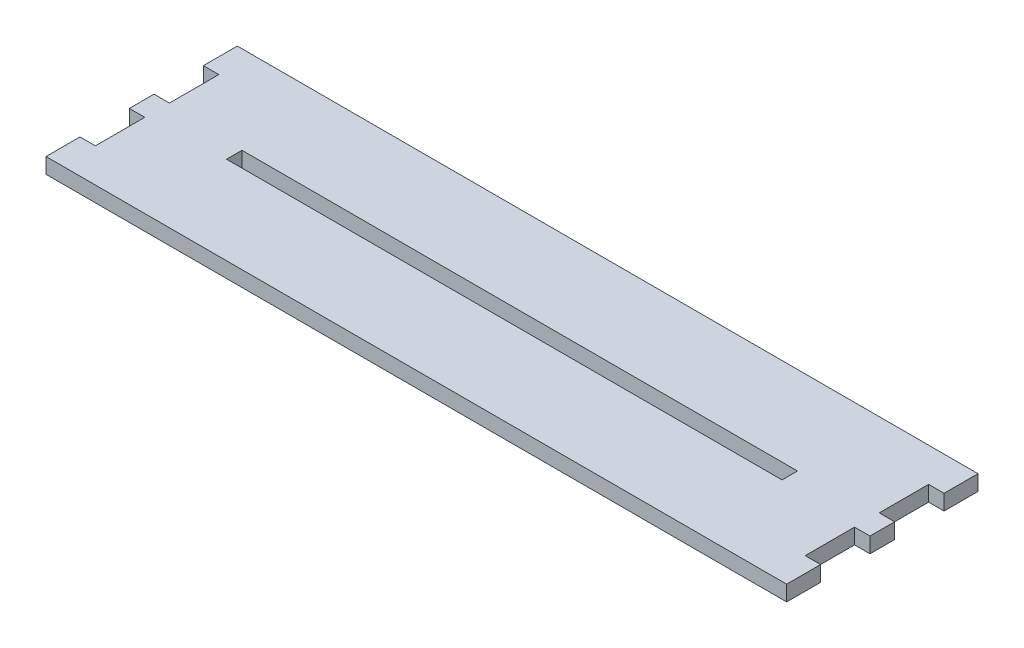
ISO-10303-21;
HEADER;
FILE_DESCRIPTION(('STEP AP214'),'2;1');
FILE_NAME('part.step','',(''),(''),'','','');
FILE_SCHEMA(('AUTOMOTIVE_DESIGN { 1 0 10303 214 1 1 1 1 }'));
ENDSEC;
DATA;
#1=APPLICATION_CONTEXT('core data for automotive mechanical design processes');
#2=APPLICATION_PROTOCOL_DEFINITION('international standard','automotive_design',2000,#1);
#3=PRODUCT_CONTEXT('',#1,'mechanical');
#4=PRODUCT('Part','Part','',(#3));
#5=PRODUCT_RELATED_PRODUCT_CATEGORY('part','',(#4));
#6=PRODUCT_DEFINITION_FORMATION('','',#4);
#7=PRODUCT_DEFINITION_CONTEXT('part definition',#1,'design');
#8=PRODUCT_DEFINITION('design','',#6,#7);
#9=PRODUCT_DEFINITION_SHAPE('','',#8);
#10=(LENGTH_UNIT() NAMED_UNIT(*) SI_UNIT(.MILLI.,.METRE.));
#11=(NAMED_UNIT(*) PLANE_ANGLE_UNIT() SI_UNIT($,.RADIAN.));
#12=(NAMED_UNIT(*) SI_UNIT($,.STERADIAN.) SOLID_ANGLE_UNIT());
#13=UNCERTAINTY_MEASURE_WITH_UNIT(LENGTH_MEASURE(1.E-05),#10,'distance_accuracy_value','');
#14=(GEOMETRIC_REPRESENTATION_CONTEXT(3) GLOBAL_UNCERTAINTY_ASSIGNED_CONTEXT((#13)) GLOBAL_UNIT_ASSIGNED_CONTEXT((#10,
#11,#12)) REPRESENTATION_CONTEXT('',''));
#15=CARTESIAN_POINT('',(0.,0.,0.));
#16=DIRECTION('',(0.,0.,1.));
#17=DIRECTION('',(1.,0.,0.));
#18=AXIS2_PLACEMENT_3D('',#15,#16,#17);
#19=CARTESIAN_POINT('',(-42.8526222222222,3.175,-17.4639111111111));
#20=DIRECTION('',(1.,0.,0.));
#21=DIRECTION('',(0.,0.,-1.));
#22=AXIS2_PLACEMENT_3D('',#19,#20,#21);
#23=PLANE('',#22);
#24=DIRECTION('',(0.,0.,1.));
#25=VECTOR('',#24,1.);
#26=CARTESIAN_POINT('',(-42.8526222222222,0.,-17.4639111111111));
#27=LINE('',#26,#25);
#28=CARTESIAN_POINT('',(-42.8526222222222,0.,-17.4639111111111));
#29=VERTEX_POINT('',#28);
#30=CARTESIAN_POINT('',(-42.8526222222222,0.,-10.4789111111111));
#31=VERTEX_POINT('',#30);
#32=EDGE_CURVE('E225',#29,#31,#27,.T.);
#33=ORIENTED_EDGE('',*,*,#32,.T.);
#34=DIRECTION('',(0.,-1.,0.));
#35=VECTOR('',#34,1.);
#36=CARTESIAN_POINT('',(-42.8526222222222,3.175,-10.4789111111111));
#37=LINE('',#36,#35);
#38=CARTESIAN_POINT('',(-42.8526222222222,3.175,-10.4789111111111));
#39=VERTEX_POINT('',#38);
#40=EDGE_CURVE('E11',#39,#31,#37,.T.);
#41=ORIENTED_EDGE('',*,*,#40,.F.);
#42=DIRECTION('',(0.,0.,1.));
#43=VECTOR('',#42,1.);
#44=CARTESIAN_POINT('',(-42.8526222222222,3.175,-17.4639111111111));
#45=LINE('',#44,#43);
#46=CARTESIAN_POINT('',(-42.8526222222222,3.175,-17.4639111111111));
#47=VERTEX_POINT('',#46);
#48=EDGE_CURVE('E229',#47,#39,#45,.T.);
#49=ORIENTED_EDGE('',*,*,#48,.F.);
#50=DIRECTION('',(0.,-1.,0.));
#51=VECTOR('',#50,1.);
#52=CARTESIAN_POINT('',(-42.8526222222222,3.175,-17.4639111111111));
#53=LINE('',#52,#51);
#54=EDGE_CURVE('E280',#47,#29,#53,.T.);
#55=ORIENTED_EDGE('',*,*,#54,.T.);
#56=EDGE_LOOP('',(#33,#41,#49,#55));
#57=FACE_BOUND('',#56,.T.);
#58=ADVANCED_FACE('F33',(#57),#23,.F.);
#59=CARTESIAN_POINT('',(-39.6776222222222,3.175,-10.4789111111111));
#60=DIRECTION('',(0.,0.,1.));
#61=DIRECTION('',(1.,0.,0.));
#62=AXIS2_PLACEMENT_3D('',#59,#60,#61);
#63=PLANE('',#62);
#64=DIRECTION('',(-1.,0.,0.));
#65=VECTOR('',#64,1.);
#66=CARTESIAN_POINT('',(-39.6776222222222,0.,-10.4789111111111));
#67=LINE('',#66,#65);
#68=CARTESIAN_POINT('',(-39.6776222222222,0.,-10.4789111111111));
#69=VERTEX_POINT('',#68);
#70=EDGE_CURVE('E283',#69,#31,#67,.T.);
#71=ORIENTED_EDGE('',*,*,#70,.F.);
#72=DIRECTION('',(0.,-1.,0.));
#73=VECTOR('',#72,1.);
#74=CARTESIAN_POINT('',(-39.6776222222222,3.175,-10.4789111111111));
#75=LINE('',#74,#73);
#76=CARTESIAN_POINT('',(-39.6776222222222,3.175,-10.4789111111111));
#77=VERTEX_POINT('',#76);
#78=EDGE_CURVE('E40',#77,#69,#75,.T.);
#79=ORIENTED_EDGE('',*,*,#78,.F.);
#80=DIRECTION('',(-1.,0.,0.));
#81=VECTOR('',#80,1.);
#82=CARTESIAN_POINT('',(-39.6776222222222,3.175,-10.4789111111111));
#83=LINE('',#82,#81);
#84=EDGE_CURVE('E231',#77,#39,#83,.T.);
#85=ORIENTED_EDGE('',*,*,#84,.T.);
#86=ORIENTED_EDGE('',*,*,#40,.T.);
#87=EDGE_LOOP('',(#71,#79,#85,#86));
#88=FACE_BOUND('',#87,.T.);
#89=ADVANCED_FACE('F384',(#88),#63,.T.);
#90=CARTESIAN_POINT('',(-39.6776222222222,3.175,-10.4789111111111));
#91=DIRECTION('',(1.,0.,0.));
#92=DIRECTION('',(0.,0.,-1.));
#93=AXIS2_PLACEMENT_3D('',#90,#91,#92);
#94=PLANE('',#93);
#95=DIRECTION('',(0.,0.,1.));
#96=VECTOR('',#95,1.);
#97=CARTESIAN_POINT('',(-39.6776222222222,0.,-10.4789111111111));
#98=LINE('',#97,#96);
#99=CARTESIAN_POINT('',(-39.6776222222222,0.,-0.318911111111101));
#100=VERTEX_POINT('',#99);
#101=EDGE_CURVE('E286',#69,#100,#98,.T.);
#102=ORIENTED_EDGE('',*,*,#101,.T.);
#103=DIRECTION('',(0.,-1.,0.));
#104=VECTOR('',#103,1.);
#105=CARTESIAN_POINT('',(-39.6776222222222,3.175,-0.318911111111101));
#106=LINE('',#105,#104);
#107=CARTESIAN_POINT('',(-39.6776222222222,3.175,-0.318911111111101));
#108=VERTEX_POINT('',#107);
#109=EDGE_CURVE('E371',#108,#100,#106,.T.);
#110=ORIENTED_EDGE('',*,*,#109,.F.);
#111=DIRECTION('',(0.,0.,1.));
#112=VECTOR('',#111,1.);
#113=CARTESIAN_POINT('',(-39.6776222222222,3.175,-10.4789111111111));
#114=LINE('',#113,#112);
#115=EDGE_CURVE('E235',#77,#108,#114,.T.);
#116=ORIENTED_EDGE('',*,*,#115,.F.);
#117=ORIENTED_EDGE('',*,*,#78,.T.);
#118=EDGE_LOOP('',(#102,#110,#116,#117));
#119=FACE_BOUND('',#118,.T.);
#120=ADVANCED_FACE('F376',(#119),#94,.F.);
#121=CARTESIAN_POINT('',(-39.6776222222222,3.175,-0.318911111111101));
#122=DIRECTION('',(0.,0.,1.));
#123=DIRECTION('',(1.,0.,0.));
#124=AXIS2_PLACEMENT_3D('',#121,#122,#123);
#125=PLANE('',#124);
#126=DIRECTION('',(-1.,0.,0.));
#127=VECTOR('',#126,1.);
#128=CARTESIAN_POINT('',(-39.6776222222222,0.,-0.318911111111101));
#129=LINE('',#128,#127);
#130=CARTESIAN_POINT('',(-42.8526222222222,0.,-0.318911111111101));
#131=VERTEX_POINT('',#130);
#132=EDGE_CURVE('E288',#100,#131,#129,.T.);
#133=ORIENTED_EDGE('',*,*,#132,.T.);
#134=DIRECTION('',(0.,-1.,0.));
#135=VECTOR('',#134,1.);
#136=CARTESIAN_POINT('',(-42.8526222222222,3.175,-0.318911111111101));
#137=LINE('',#136,#135);
#138=CARTESIAN_POINT('',(-42.8526222222222,3.175,-0.318911111111101));
#139=VERTEX_POINT('',#138);
#140=EDGE_CURVE('E368',#139,#131,#137,.T.);
#141=ORIENTED_EDGE('',*,*,#140,.F.);
#142=DIRECTION('',(-1.,0.,0.));
#143=VECTOR('',#142,1.);
#144=CARTESIAN_POINT('',(-39.6776222222222,3.175,-0.318911111111101));
#145=LINE('',#144,#143);
#146=EDGE_CURVE('E237',#108,#139,#145,.T.);
#147=ORIENTED_EDGE('',*,*,#146,.F.);
#148=ORIENTED_EDGE('',*,*,#109,.T.);
#149=EDGE_LOOP('',(#133,#141,#147,#148));
#150=FACE_BOUND('',#149,.T.);
#151=ADVANCED_FACE('F460',(#150),#125,.F.);
#152=CARTESIAN_POINT('',(-42.8526222222222,3.175,-0.318911111111101));
#153=DIRECTION('',(1.,0.,0.));
#154=DIRECTION('',(0.,0.,-1.));
#155=AXIS2_PLACEMENT_3D('',#152,#153,#154);
#156=PLANE('',#155);
#157=DIRECTION('',(0.,0.,1.));
#158=VECTOR('',#157,1.);
#159=CARTESIAN_POINT('',(-42.8526222222222,0.,-0.318911111111101));
#160=LINE('',#159,#158);
#161=CARTESIAN_POINT('',(-42.8526222222222,0.,4.7610888888889));
#162=VERTEX_POINT('',#161);
#163=EDGE_CURVE('E290',#131,#162,#160,.T.);
#164=ORIENTED_EDGE('',*,*,#163,.T.);
#165=DIRECTION('',(0.,-1.,0.));
#166=VECTOR('',#165,1.);
#167=CARTESIAN_POINT('',(-42.8526222222222,3.175,4.7610888888889));
#168=LINE('',#167,#166);
#169=CARTESIAN_POINT('',(-42.8526222222222,3.175,4.7610888888889));
#170=VERTEX_POINT('',#169);
#171=EDGE_CURVE('E366',#170,#162,#168,.T.);
#172=ORIENTED_EDGE('',*,*,#171,.F.);
#173=DIRECTION('',(0.,0.,1.));
#174=VECTOR('',#173,1.);
#175=CARTESIAN_POINT('',(-42.8526222222222,3.175,-0.318911111111101));
#176=LINE('',#175,#174);
#177=EDGE_CURVE('E239',#139,#170,#176,.T.);
#178=ORIENTED_EDGE('',*,*,#177,.F.);
#179=ORIENTED_EDGE('',*,*,#140,.T.);
#180=EDGE_LOOP('',(#164,#172,#178,#179));
#181=FACE_BOUND('',#180,.T.);
#182=ADVANCED_FACE('F455',(#181),#156,.F.);
#183=CARTESIAN_POINT('',(-39.6776222222222,3.175,4.7610888888889));
#184=DIRECTION('',(0.,0.,1.));
#185=DIRECTION('',(1.,0.,0.));
#186=AXIS2_PLACEMENT_3D('',#183,#184,#185);
#187=PLANE('',#186);
#188=DIRECTION('',(-1.,0.,0.));
#189=VECTOR('',#188,1.);
#190=CARTESIAN_POINT('',(-39.6776222222222,0.,4.7610888888889));
#191=LINE('',#190,#189);
#192=CARTESIAN_POINT('',(-39.6776222222222,0.,4.7610888888889));
#193=VERTEX_POINT('',#192);
#194=EDGE_CURVE('E293',#193,#162,#191,.T.);
#195=ORIENTED_EDGE('',*,*,#194,.F.);
#196=DIRECTION('',(0.,-1.,0.));
#197=VECTOR('',#196,1.);
#198=CARTESIAN_POINT('',(-39.6776222222222,3.175,4.7610888888889));
#199=LINE('',#198,#197);
#200=CARTESIAN_POINT('',(-39.6776222222222,3.175,4.7610888888889));
#201=VERTEX_POINT('',#200);
#202=EDGE_CURVE('E364',#201,#193,#199,.T.);
#203=ORIENTED_EDGE('',*,*,#202,.F.);
#204=DIRECTION('',(-1.,0.,0.));
#205=VECTOR('',#204,1.);
#206=CARTESIAN_POINT('',(-39.6776222222222,3.175,4.7610888888889));
#207=LINE('',#206,#205);
#208=EDGE_CURVE('E241',#201,#170,#207,.T.);
#209=ORIENTED_EDGE('',*,*,#208,.T.);
#210=ORIENTED_EDGE('',*,*,#171,.T.);
#211=EDGE_LOOP('',(#195,#203,#209,#210));
#212=FACE_BOUND('',#211,.T.);
#213=ADVANCED_FACE('F452',(#212),#187,.T.);
#214=CARTESIAN_POINT('',(-39.6776222222222,3.175,14.9210888888889));
#215=DIRECTION('',(-1.,0.,0.));
#216=DIRECTION('',(0.,0.,1.));
#217=AXIS2_PLACEMENT_3D('',#214,#215,#216);
#218=PLANE('',#217);
#219=DIRECTION('',(0.,0.,-1.));
#220=VECTOR('',#219,1.);
#221=CARTESIAN_POINT('',(-39.6776222222222,0.,14.9210888888889));
#222=LINE('',#221,#220);
#223=CARTESIAN_POINT('',(-39.6776222222222,0.,14.9210888888889));
#224=VERTEX_POINT('',#223);
#225=EDGE_CURVE('E296',#224,#193,#222,.T.);
#226=ORIENTED_EDGE('',*,*,#225,.F.);
#227=DIRECTION('',(0.,-1.,0.));
#228=VECTOR('',#227,1.);
#229=CARTESIAN_POINT('',(-39.6776222222222,3.175,14.9210888888889));
#230=LINE('',#229,#228);
#231=CARTESIAN_POINT('',(-39.6776222222222,3.175,14.9210888888889));
#232=VERTEX_POINT('',#231);
#233=EDGE_CURVE('E362',#232,#224,#230,.T.);
#234=ORIENTED_EDGE('',*,*,#233,.F.);
#235=DIRECTION('',(0.,0.,-1.));
#236=VECTOR('',#235,1.);
#237=CARTESIAN_POINT('',(-39.6776222222222,3.175,14.9210888888889));
#238=LINE('',#237,#236);
#239=EDGE_CURVE('E244',#232,#201,#238,.T.);
#240=ORIENTED_EDGE('',*,*,#239,.T.);
#241=ORIENTED_EDGE('',*,*,#202,.T.);
#242=EDGE_LOOP('',(#226,#234,#240,#241));
#243=FACE_BOUND('',#242,.T.);
#244=ADVANCED_FACE('F448',(#243),#218,.T.);
#245=CARTESIAN_POINT('',(-39.6776222222222,3.175,14.9210888888889));
#246=DIRECTION('',(0.,0.,1.));
#247=DIRECTION('',(1.,0.,0.));
#248=AXIS2_PLACEMENT_3D('',#245,#246,#247);
#249=PLANE('',#248);
#250=DIRECTION('',(-1.,0.,0.));
#251=VECTOR('',#250,1.);
#252=CARTESIAN_POINT('',(-39.6776222222222,0.,14.9210888888889));
#253=LINE('',#252,#251);
#254=CARTESIAN_POINT('',(-42.8526222222222,0.,14.9210888888889));
#255=VERTEX_POINT('',#254);
#256=EDGE_CURVE('E299',#224,#255,#253,.T.);
#257=ORIENTED_EDGE('',*,*,#256,.T.);
#258=DIRECTION('',(0.,-1.,0.));
#259=VECTOR('',#258,1.);
#260=CARTESIAN_POINT('',(-42.8526222222222,3.175,14.9210888888889));
#261=LINE('',#260,#259);
#262=CARTESIAN_POINT('',(-42.8526222222222,3.175,14.9210888888889));
#263=VERTEX_POINT('',#262);
#264=EDGE_CURVE('E359',#263,#255,#261,.T.);
#265=ORIENTED_EDGE('',*,*,#264,.F.);
#266=DIRECTION('',(-1.,0.,0.));
#267=VECTOR('',#266,1.);
#268=CARTESIAN_POINT('',(-39.6776222222222,3.175,14.9210888888889));
#269=LINE('',#268,#267);
#270=EDGE_CURVE('E247',#232,#263,#269,.T.);
#271=ORIENTED_EDGE('',*,*,#270,.F.);
#272=ORIENTED_EDGE('',*,*,#233,.T.);
#273=EDGE_LOOP('',(#257,#265,#271,#272));
#274=FACE_BOUND('',#273,.T.);
#275=ADVANCED_FACE('F444',(#274),#249,.F.);
#276=CARTESIAN_POINT('',(-42.8526222222222,3.175,14.9210888888889));
#277=DIRECTION('',(1.,0.,0.));
#278=DIRECTION('',(0.,0.,-1.));
#279=AXIS2_PLACEMENT_3D('',#276,#277,#278);
#280=PLANE('',#279);
#281=DIRECTION('',(0.,0.,1.));
#282=VECTOR('',#281,1.);
#283=CARTESIAN_POINT('',(-42.8526222222222,0.,14.9210888888889));
#284=LINE('',#283,#282);
#285=CARTESIAN_POINT('',(-42.8526222222222,0.,21.9060888888889));
#286=VERTEX_POINT('',#285);
#287=EDGE_CURVE('E301',#255,#286,#284,.T.);
#288=ORIENTED_EDGE('',*,*,#287,.T.);
#289=DIRECTION('',(0.,-1.,0.));
#290=VECTOR('',#289,1.);
#291=CARTESIAN_POINT('',(-42.8526222222222,3.175,21.9060888888889));
#292=LINE('',#291,#290);
#293=CARTESIAN_POINT('',(-42.8526222222222,3.175,21.9060888888889));
#294=VERTEX_POINT('',#293);
#295=EDGE_CURVE('E356',#294,#286,#292,.T.);
#296=ORIENTED_EDGE('',*,*,#295,.F.);
#297=DIRECTION('',(0.,0.,1.));
#298=VECTOR('',#297,1.);
#299=CARTESIAN_POINT('',(-42.8526222222222,3.175,14.9210888888889));
#300=LINE('',#299,#298);
#301=EDGE_CURVE('E249',#263,#294,#300,.T.);
#302=ORIENTED_EDGE('',*,*,#301,.F.);
#303=ORIENTED_EDGE('',*,*,#264,.T.);
#304=EDGE_LOOP('',(#288,#296,#302,#303));
#305=FACE_BOUND('',#304,.T.);
#306=ADVANCED_FACE('F440',(#305),#280,.F.);
#307=CARTESIAN_POINT('',(-42.8526222222222,3.175,21.9060888888889));
#308=DIRECTION('',(0.,0.,-1.));
#309=DIRECTION('',(-1.,0.,0.));
#310=AXIS2_PLACEMENT_3D('',#307,#308,#309);
#311=PLANE('',#310);
#312=DIRECTION('',(1.,0.,0.));
#313=VECTOR('',#312,1.);
#314=CARTESIAN_POINT('',(-42.8526222222222,0.,21.9060888888889));
#315=LINE('',#314,#313);
#316=CARTESIAN_POINT('',(109.547377777778,0.,21.9060888888889));
#317=VERTEX_POINT('',#316);
#318=EDGE_CURVE('E303',#286,#317,#315,.T.);
#319=ORIENTED_EDGE('',*,*,#318,.T.);
#320=DIRECTION('',(0.,-1.,0.));
#321=VECTOR('',#320,1.);
#322=CARTESIAN_POINT('',(109.547377777778,3.175,21.9060888888889));
#323=LINE('',#322,#321);
#324=CARTESIAN_POINT('',(109.547377777778,3.175,21.9060888888889));
#325=VERTEX_POINT('',#324);
#326=EDGE_CURVE('E354',#325,#317,#323,.T.);
#327=ORIENTED_EDGE('',*,*,#326,.F.);
#328=DIRECTION('',(1.,0.,0.));
#329=VECTOR('',#328,1.);
#330=CARTESIAN_POINT('',(-42.8526222222222,3.175,21.9060888888889));
#331=LINE('',#330,#329);
#332=EDGE_CURVE('E251',#294,#325,#331,.T.);
#333=ORIENTED_EDGE('',*,*,#332,.F.);
#334=ORIENTED_EDGE('',*,*,#295,.T.);
#335=EDGE_LOOP('',(#319,#327,#333,#334));
#336=FACE_BOUND('',#335,.T.);
#337=ADVANCED_FACE('F435',(#336),#311,.F.);
#338=CARTESIAN_POINT('',(109.547377777778,3.175,14.9210888888889));
#339=DIRECTION('',(1.,0.,0.));
#340=DIRECTION('',(0.,0.,-1.));
#341=AXIS2_PLACEMENT_3D('',#338,#339,#340);
#342=PLANE('',#341);
#343=DIRECTION('',(0.,0.,1.));
#344=VECTOR('',#343,1.);
#345=CARTESIAN_POINT('',(109.547377777778,0.,14.9210888888889));
#346=LINE('',#345,#344);
#347=CARTESIAN_POINT('',(109.547377777778,0.,14.9210888888889));
#348=VERTEX_POINT('',#347);
#349=EDGE_CURVE('E306',#348,#317,#346,.T.);
#350=ORIENTED_EDGE('',*,*,#349,.F.);
#351=DIRECTION('',(0.,-1.,0.));
#352=VECTOR('',#351,1.);
#353=CARTESIAN_POINT('',(109.547377777778,3.175,14.9210888888889));
#354=LINE('',#353,#352);
#355=CARTESIAN_POINT('',(109.547377777778,3.175,14.9210888888889));
#356=VERTEX_POINT('',#355);
#357=EDGE_CURVE('E352',#356,#348,#354,.T.);
#358=ORIENTED_EDGE('',*,*,#357,.F.);
#359=DIRECTION('',(0.,0.,1.));
#360=VECTOR('',#359,1.);
#361=CARTESIAN_POINT('',(109.547377777778,3.175,14.9210888888889));
#362=LINE('',#361,#360);
#363=EDGE_CURVE('E253',#356,#325,#362,.T.);
#364=ORIENTED_EDGE('',*,*,#363,.T.);
#365=ORIENTED_EDGE('',*,*,#326,.T.);
#366=EDGE_LOOP('',(#350,#358,#364,#365));
#367=FACE_BOUND('',#366,.T.);
#368=ADVANCED_FACE('F429',(#367),#342,.T.);
#369=CARTESIAN_POINT('',(106.372377777778,3.175,14.9210888888889));
#370=DIRECTION('',(0.,0.,-1.));
#371=DIRECTION('',(-1.,0.,0.));
#372=AXIS2_PLACEMENT_3D('',#369,#370,#371);
#373=PLANE('',#372);
#374=DIRECTION('',(1.,0.,0.));
#375=VECTOR('',#374,1.);
#376=CARTESIAN_POINT('',(106.372377777778,0.,14.9210888888889));
#377=LINE('',#376,#375);
#378=CARTESIAN_POINT('',(106.372377777778,0.,14.9210888888889));
#379=VERTEX_POINT('',#378);
#380=EDGE_CURVE('E309',#379,#348,#377,.T.);
#381=ORIENTED_EDGE('',*,*,#380,.F.);
#382=DIRECTION('',(0.,-1.,0.));
#383=VECTOR('',#382,1.);
#384=CARTESIAN_POINT('',(106.372377777778,3.175,14.9210888888889));
#385=LINE('',#384,#383);
#386=CARTESIAN_POINT('',(106.372377777778,3.175,14.9210888888889));
#387=VERTEX_POINT('',#386);
#388=EDGE_CURVE('E350',#387,#379,#385,.T.);
#389=ORIENTED_EDGE('',*,*,#388,.F.);
#390=DIRECTION('',(1.,0.,0.));
#391=VECTOR('',#390,1.);
#392=CARTESIAN_POINT('',(106.372377777778,3.175,14.9210888888889));
#393=LINE('',#392,#391);
#394=EDGE_CURVE('E256',#387,#356,#393,.T.);
#395=ORIENTED_EDGE('',*,*,#394,.T.);
#396=ORIENTED_EDGE('',*,*,#357,.T.);
#397=EDGE_LOOP('',(#381,#389,#395,#396));
#398=FACE_BOUND('',#397,.T.);
#399=ADVANCED_FACE('F425',(#398),#373,.T.);
#400=CARTESIAN_POINT('',(106.372377777778,3.175,14.9210888888889));
#401=DIRECTION('',(-1.,0.,0.));
#402=DIRECTION('',(0.,0.,1.));
#403=AXIS2_PLACEMENT_3D('',#400,#401,#402);
#404=PLANE('',#403);
#405=DIRECTION('',(0.,0.,-1.));
#406=VECTOR('',#405,1.);
#407=CARTESIAN_POINT('',(106.372377777778,0.,14.9210888888889));
#408=LINE('',#407,#406);
#409=CARTESIAN_POINT('',(106.372377777778,0.,4.7610888888889));
#410=VERTEX_POINT('',#409);
#411=EDGE_CURVE('E312',#379,#410,#408,.T.);
#412=ORIENTED_EDGE('',*,*,#411,.T.);
#413=DIRECTION('',(0.,-1.,0.));
#414=VECTOR('',#413,1.);
#415=CARTESIAN_POINT('',(106.372377777778,3.175,4.7610888888889));
#416=LINE('',#415,#414);
#417=CARTESIAN_POINT('',(106.372377777778,3.175,4.7610888888889));
#418=VERTEX_POINT('',#417);
#419=EDGE_CURVE('E347',#418,#410,#416,.T.);
#420=ORIENTED_EDGE('',*,*,#419,.F.);
#421=DIRECTION('',(0.,0.,-1.));
#422=VECTOR('',#421,1.);
#423=CARTESIAN_POINT('',(106.372377777778,3.175,14.9210888888889));
#424=LINE('',#423,#422);
#425=EDGE_CURVE('E259',#387,#418,#424,.T.);
#426=ORIENTED_EDGE('',*,*,#425,.F.);
#427=ORIENTED_EDGE('',*,*,#388,.T.);
#428=EDGE_LOOP('',(#412,#420,#426,#427));
#429=FACE_BOUND('',#428,.T.);
#430=ADVANCED_FACE('F421',(#429),#404,.F.);
#431=CARTESIAN_POINT('',(106.372377777778,3.175,4.7610888888889));
#432=DIRECTION('',(0.,0.,-1.));
#433=DIRECTION('',(-1.,0.,0.));
#434=AXIS2_PLACEMENT_3D('',#431,#432,#433);
#435=PLANE('',#434);
#436=DIRECTION('',(1.,0.,0.));
#437=VECTOR('',#436,1.);
#438=CARTESIAN_POINT('',(106.372377777778,0.,4.7610888888889));
#439=LINE('',#438,#437);
#440=CARTESIAN_POINT('',(109.547377777778,0.,4.7610888888889));
#441=VERTEX_POINT('',#440);
#442=EDGE_CURVE('E314',#410,#441,#439,.T.);
#443=ORIENTED_EDGE('',*,*,#442,.T.);
#444=DIRECTION('',(0.,-1.,0.));
#445=VECTOR('',#444,1.);
#446=CARTESIAN_POINT('',(109.547377777778,3.175,4.7610888888889));
#447=LINE('',#446,#445);
#448=CARTESIAN_POINT('',(109.547377777778,3.175,4.7610888888889));
#449=VERTEX_POINT('',#448);
#450=EDGE_CURVE('E345',#449,#441,#447,.T.);
#451=ORIENTED_EDGE('',*,*,#450,.F.);
#452=DIRECTION('',(1.,0.,0.));
#453=VECTOR('',#452,1.);
#454=CARTESIAN_POINT('',(106.372377777778,3.175,4.7610888888889));
#455=LINE('',#454,#453);
#456=EDGE_CURVE('E261',#418,#449,#455,.T.);
#457=ORIENTED_EDGE('',*,*,#456,.F.);
#458=ORIENTED_EDGE('',*,*,#419,.T.);
#459=EDGE_LOOP('',(#443,#451,#457,#458));
#460=FACE_BOUND('',#459,.T.);
#461=ADVANCED_FACE('F417',(#460),#435,.F.);
#462=CARTESIAN_POINT('',(109.547377777778,3.175,-0.318911111111101));
#463=DIRECTION('',(1.,0.,0.));
#464=DIRECTION('',(0.,0.,-1.));
#465=AXIS2_PLACEMENT_3D('',#462,#463,#464);
#466=PLANE('',#465);
#467=DIRECTION('',(0.,0.,1.));
#468=VECTOR('',#467,1.);
#469=CARTESIAN_POINT('',(109.547377777778,0.,-0.318911111111101));
#470=LINE('',#469,#468);
#471=CARTESIAN_POINT('',(109.547377777778,0.,-0.318911111111101));
#472=VERTEX_POINT('',#471);
#473=EDGE_CURVE('E317',#472,#441,#470,.T.);
#474=ORIENTED_EDGE('',*,*,#473,.F.);
#475=DIRECTION('',(0.,-1.,0.));
#476=VECTOR('',#475,1.);
#477=CARTESIAN_POINT('',(109.547377777778,3.175,-0.318911111111101));
#478=LINE('',#477,#476);
#479=CARTESIAN_POINT('',(109.547377777778,3.175,-0.318911111111101));
#480=VERTEX_POINT('',#479);
#481=EDGE_CURVE('E343',#480,#472,#478,.T.);
#482=ORIENTED_EDGE('',*,*,#481,.F.);
#483=DIRECTION('',(0.,0.,1.));
#484=VECTOR('',#483,1.);
#485=CARTESIAN_POINT('',(109.547377777778,3.175,-0.318911111111101));
#486=LINE('',#485,#484);
#487=EDGE_CURVE('E263',#480,#449,#486,.T.);
#488=ORIENTED_EDGE('',*,*,#487,.T.);
#489=ORIENTED_EDGE('',*,*,#450,.T.);
#490=EDGE_LOOP('',(#474,#482,#488,#489));
#491=FACE_BOUND('',#490,.T.);
#492=ADVANCED_FACE('F412',(#491),#466,.T.);
#493=CARTESIAN_POINT('',(106.372377777778,3.175,-0.318911111111101));
#494=DIRECTION('',(0.,0.,-1.));
#495=DIRECTION('',(-1.,0.,0.));
#496=AXIS2_PLACEMENT_3D('',#493,#494,#495);
#497=PLANE('',#496);
#498=DIRECTION('',(1.,0.,0.));
#499=VECTOR('',#498,1.);
#500=CARTESIAN_POINT('',(106.372377777778,0.,-0.318911111111101));
#501=LINE('',#500,#499);
#502=CARTESIAN_POINT('',(106.372377777778,0.,-0.318911111111101));
#503=VERTEX_POINT('',#502);
#504=EDGE_CURVE('E320',#503,#472,#501,.T.);
#505=ORIENTED_EDGE('',*,*,#504,.F.);
#506=DIRECTION('',(0.,-1.,0.));
#507=VECTOR('',#506,1.);
#508=CARTESIAN_POINT('',(106.372377777778,3.175,-0.318911111111101));
#509=LINE('',#508,#507);
#510=CARTESIAN_POINT('',(106.372377777778,3.175,-0.318911111111101));
#511=VERTEX_POINT('',#510);
#512=EDGE_CURVE('E341',#511,#503,#509,.T.);
#513=ORIENTED_EDGE('',*,*,#512,.F.);
#514=DIRECTION('',(1.,0.,0.));
#515=VECTOR('',#514,1.);
#516=CARTESIAN_POINT('',(106.372377777778,3.175,-0.318911111111101));
#517=LINE('',#516,#515);
#518=EDGE_CURVE('E266',#511,#480,#517,.T.);
#519=ORIENTED_EDGE('',*,*,#518,.T.);
#520=ORIENTED_EDGE('',*,*,#481,.T.);
#521=EDGE_LOOP('',(#505,#513,#519,#520));
#522=FACE_BOUND('',#521,.T.);
#523=ADVANCED_FACE('F407',(#522),#497,.T.);
#524=CARTESIAN_POINT('',(106.372377777778,3.175,-10.4789111111111));
#525=DIRECTION('',(1.,0.,0.));
#526=DIRECTION('',(0.,0.,-1.));
#527=AXIS2_PLACEMENT_3D('',#524,#525,#526);
#528=PLANE('',#527);
#529=DIRECTION('',(0.,0.,1.));
#530=VECTOR('',#529,1.);
#531=CARTESIAN_POINT('',(106.372377777778,0.,-10.4789111111111));
#532=LINE('',#531,#530);
#533=CARTESIAN_POINT('',(106.372377777778,0.,-10.4789111111111));
#534=VERTEX_POINT('',#533);
#535=EDGE_CURVE('E323',#534,#503,#532,.T.);
#536=ORIENTED_EDGE('',*,*,#535,.F.);
#537=DIRECTION('',(0.,-1.,0.));
#538=VECTOR('',#537,1.);
#539=CARTESIAN_POINT('',(106.372377777778,3.175,-10.4789111111111));
#540=LINE('',#539,#538);
#541=CARTESIAN_POINT('',(106.372377777778,3.175,-10.4789111111111));
#542=VERTEX_POINT('',#541);
#543=EDGE_CURVE('E339',#542,#534,#540,.T.);
#544=ORIENTED_EDGE('',*,*,#543,.F.);
#545=DIRECTION('',(0.,0.,1.));
#546=VECTOR('',#545,1.);
#547=CARTESIAN_POINT('',(106.372377777778,3.175,-10.4789111111111));
#548=LINE('',#547,#546);
#549=EDGE_CURVE('E269',#542,#511,#548,.T.);
#550=ORIENTED_EDGE('',*,*,#549,.T.);
#551=ORIENTED_EDGE('',*,*,#512,.T.);
#552=EDGE_LOOP('',(#536,#544,#550,#551));
#553=FACE_BOUND('',#552,.T.);
#554=ADVANCED_FACE('F401',(#553),#528,.T.);
#555=CARTESIAN_POINT('',(106.372377777778,3.175,-10.4789111111111));
#556=DIRECTION('',(0.,0.,-1.));
#557=DIRECTION('',(-1.,0.,0.));
#558=AXIS2_PLACEMENT_3D('',#555,#556,#557);
#559=PLANE('',#558);
#560=DIRECTION('',(1.,0.,0.));
#561=VECTOR('',#560,1.);
#562=CARTESIAN_POINT('',(106.372377777778,0.,-10.4789111111111));
#563=LINE('',#562,#561);
#564=CARTESIAN_POINT('',(109.547377777778,0.,-10.4789111111111));
#565=VERTEX_POINT('',#564);
#566=EDGE_CURVE('E326',#534,#565,#563,.T.);
#567=ORIENTED_EDGE('',*,*,#566,.T.);
#568=DIRECTION('',(0.,-1.,0.));
#569=VECTOR('',#568,1.);
#570=CARTESIAN_POINT('',(109.547377777778,3.175,-10.4789111111111));
#571=LINE('',#570,#569);
#572=CARTESIAN_POINT('',(109.547377777778,3.175,-10.4789111111111));
#573=VERTEX_POINT('',#572);
#574=EDGE_CURVE('E337',#573,#565,#571,.T.);
#575=ORIENTED_EDGE('',*,*,#574,.F.);
#576=DIRECTION('',(1.,0.,0.));
#577=VECTOR('',#576,1.);
#578=CARTESIAN_POINT('',(106.372377777778,3.175,-10.4789111111111));
#579=LINE('',#578,#577);
#580=EDGE_CURVE('E272',#542,#573,#579,.T.);
#581=ORIENTED_EDGE('',*,*,#580,.F.);
#582=ORIENTED_EDGE('',*,*,#543,.T.);
#583=EDGE_LOOP('',(#567,#575,#581,#582));
#584=FACE_BOUND('',#583,.T.);
#585=ADVANCED_FACE('F463',(#584),#559,.F.);
#586=CARTESIAN_POINT('',(109.547377777778,3.175,-17.4639111111111));
#587=DIRECTION('',(1.,0.,0.));
#588=DIRECTION('',(0.,0.,-1.));
#589=AXIS2_PLACEMENT_3D('',#586,#587,#588);
#590=PLANE('',#589);
#591=DIRECTION('',(0.,0.,1.));
#592=VECTOR('',#591,1.);
#593=CARTESIAN_POINT('',(109.547377777778,0.,-17.4639111111111));
#594=LINE('',#593,#592);
#595=CARTESIAN_POINT('',(109.547377777778,0.,-17.4639111111111));
#596=VERTEX_POINT('',#595);
#597=EDGE_CURVE('E329',#596,#565,#594,.T.);
#598=ORIENTED_EDGE('',*,*,#597,.F.);
#599=DIRECTION('',(0.,-1.,0.));
#600=VECTOR('',#599,1.);
#601=CARTESIAN_POINT('',(109.547377777778,3.175,-17.4639111111111));
#602=LINE('',#601,#600);
#603=CARTESIAN_POINT('',(109.547377777778,3.175,-17.4639111111111));
#604=VERTEX_POINT('',#603);
#605=EDGE_CURVE('E335',#604,#596,#602,.T.);
#606=ORIENTED_EDGE('',*,*,#605,.F.);
#607=DIRECTION('',(0.,0.,1.));
#608=VECTOR('',#607,1.);
#609=CARTESIAN_POINT('',(109.547377777778,3.175,-17.4639111111111));
#610=LINE('',#609,#608);
#611=EDGE_CURVE('E274',#604,#573,#610,.T.);
#612=ORIENTED_EDGE('',*,*,#611,.T.);
#613=ORIENTED_EDGE('',*,*,#574,.T.);
#614=EDGE_LOOP('',(#598,#606,#612,#613));
#615=FACE_BOUND('',#614,.T.);
#616=ADVANCED_FACE('F395',(#615),#590,.T.);
#617=CARTESIAN_POINT('',(-42.8526222222222,3.175,-17.4639111111111));
#618=DIRECTION('',(0.,0.,-1.));
#619=DIRECTION('',(-1.,0.,0.));
#620=AXIS2_PLACEMENT_3D('',#617,#618,#619);
#621=PLANE('',#620);
#622=DIRECTION('',(1.,0.,0.));
#623=VECTOR('',#622,1.);
#624=CARTESIAN_POINT('',(-42.8526222222222,0.,-17.4639111111111));
#625=LINE('',#624,#623);
#626=EDGE_CURVE('E232',#29,#596,#625,.T.);
#627=ORIENTED_EDGE('',*,*,#626,.F.);
#628=ORIENTED_EDGE('',*,*,#54,.F.);
#629=DIRECTION('',(1.,0.,0.));
#630=VECTOR('',#629,1.);
#631=CARTESIAN_POINT('',(-42.8526222222222,3.175,-17.4639111111111));
#632=LINE('',#631,#630);
#633=EDGE_CURVE('E277',#47,#604,#632,.T.);
#634=ORIENTED_EDGE('',*,*,#633,.T.);
#635=ORIENTED_EDGE('',*,*,#605,.T.);
#636=EDGE_LOOP('',(#627,#628,#634,#635));
#637=FACE_BOUND('',#636,.T.);
#638=ADVANCED_FACE('F390',(#637),#621,.T.);
#639=CARTESIAN_POINT('',(0.,3.175,0.));
#640=DIRECTION('',(0.,-1.,0.));
#641=DIRECTION('',(0.,0.,-1.));
#642=AXIS2_PLACEMENT_3D('',#639,#640,#641);
#643=PLANE('',#642);
#644=DIRECTION('',(-1.,0.,0.));
#645=VECTOR('',#644,1.);
#646=CARTESIAN_POINT('',(90.4973777777778,3.175,0.633588888888891));
#647=LINE('',#646,#645);
#648=CARTESIAN_POINT('',(90.4973777777778,3.175,0.633588888888891));
#649=VERTEX_POINT('',#648);
#650=CARTESIAN_POINT('',(-23.8026222222222,3.175,0.633588888888903));
#651=VERTEX_POINT('',#650);
#652=EDGE_CURVE('E219',#649,#651,#647,.T.);
#653=ORIENTED_EDGE('',*,*,#652,.F.);
#654=DIRECTION('',(0.,0.,-1.));
#655=VECTOR('',#654,1.);
#656=CARTESIAN_POINT('',(90.4973777777778,3.175,3.80858888888889));
#657=LINE('',#656,#655);
#658=CARTESIAN_POINT('',(90.4973777777778,3.175,3.80858888888889));
#659=VERTEX_POINT('',#658);
#660=EDGE_CURVE('E47',#659,#649,#657,.T.);
#661=ORIENTED_EDGE('',*,*,#660,.F.);
#662=DIRECTION('',(1.,0.,0.));
#663=VECTOR('',#662,1.);
#664=CARTESIAN_POINT('',(90.4973777777778,3.175,3.80858888888889));
#665=LINE('',#664,#663);
#666=CARTESIAN_POINT('',(-23.8026222222222,3.175,3.80858888888889));
#667=VERTEX_POINT('',#666);
#668=EDGE_CURVE('E210',#667,#659,#665,.T.);
#669=ORIENTED_EDGE('',*,*,#668,.F.);
#670=DIRECTION('',(0.,0.,1.));
#671=VECTOR('',#670,1.);
#672=CARTESIAN_POINT('',(-23.8026222222222,3.175,3.80858888888889));
#673=LINE('',#672,#671);
#674=EDGE_CURVE('E213',#651,#667,#673,.T.);
#675=ORIENTED_EDGE('',*,*,#674,.F.);
#676=EDGE_LOOP('',(#653,#661,#669,#675));
#677=FACE_BOUND('',#676,.T.);
#678=ORIENTED_EDGE('',*,*,#48,.T.);
#679=ORIENTED_EDGE('',*,*,#84,.F.);
#680=ORIENTED_EDGE('',*,*,#115,.T.);
#681=ORIENTED_EDGE('',*,*,#146,.T.);
#682=ORIENTED_EDGE('',*,*,#177,.T.);
#683=ORIENTED_EDGE('',*,*,#208,.F.);
#684=ORIENTED_EDGE('',*,*,#239,.F.);
#685=ORIENTED_EDGE('',*,*,#270,.T.);
#686=ORIENTED_EDGE('',*,*,#301,.T.);
#687=ORIENTED_EDGE('',*,*,#332,.T.);
#688=ORIENTED_EDGE('',*,*,#363,.F.);
#689=ORIENTED_EDGE('',*,*,#394,.F.);
#690=ORIENTED_EDGE('',*,*,#425,.T.);
#691=ORIENTED_EDGE('',*,*,#456,.T.);
#692=ORIENTED_EDGE('',*,*,#487,.F.);
#693=ORIENTED_EDGE('',*,*,#518,.F.);
#694=ORIENTED_EDGE('',*,*,#549,.F.);
#695=ORIENTED_EDGE('',*,*,#580,.T.);
#696=ORIENTED_EDGE('',*,*,#611,.F.);
#697=ORIENTED_EDGE('',*,*,#633,.F.);
#698=EDGE_LOOP('',(#678,#679,#680,#681,#682,#683,#684,#685,#686,#687,#688,#689,#690,#691,#692,
#693,#694,#695,#696,#697));
#699=FACE_BOUND('',#698,.T.);
#700=ADVANCED_FACE('F462',(#677,#699),#643,.F.);
#701=CARTESIAN_POINT('',(0.,0.,0.));
#702=DIRECTION('',(0.,-1.,0.));
#703=DIRECTION('',(0.,0.,-1.));
#704=AXIS2_PLACEMENT_3D('',#701,#702,#703);
#705=PLANE('',#704);
#706=DIRECTION('',(0.,0.,-1.));
#707=VECTOR('',#706,1.);
#708=CARTESIAN_POINT('',(90.4973777777778,0.,3.80858888888889));
#709=LINE('',#708,#707);
#710=CARTESIAN_POINT('',(90.4973777777778,0.,3.80858888888889));
#711=VERTEX_POINT('',#710);
#712=CARTESIAN_POINT('',(90.4973777777778,0.,0.633588888888891));
#713=VERTEX_POINT('',#712);
#714=EDGE_CURVE('E194',#711,#713,#709,.T.);
#715=ORIENTED_EDGE('',*,*,#714,.T.);
#716=DIRECTION('',(-1.,0.,0.));
#717=VECTOR('',#716,1.);
#718=CARTESIAN_POINT('',(90.4973777777778,0.,0.633588888888891));
#719=LINE('',#718,#717);
#720=CARTESIAN_POINT('',(-23.8026222222222,0.,0.633588888888903));
#721=VERTEX_POINT('',#720);
#722=EDGE_CURVE('E203',#713,#721,#719,.T.);
#723=ORIENTED_EDGE('',*,*,#722,.T.);
#724=DIRECTION('',(0.,0.,1.));
#725=VECTOR('',#724,1.);
#726=CARTESIAN_POINT('',(-23.8026222222222,0.,3.80858888888889));
#727=LINE('',#726,#725);
#728=CARTESIAN_POINT('',(-23.8026222222222,0.,3.80858888888889));
#729=VERTEX_POINT('',#728);
#730=EDGE_CURVE('E55',#721,#729,#727,.T.);
#731=ORIENTED_EDGE('',*,*,#730,.T.);
#732=DIRECTION('',(1.,0.,0.));
#733=VECTOR('',#732,1.);
#734=CARTESIAN_POINT('',(90.4973777777778,0.,3.80858888888889));
#735=LINE('',#734,#733);
#736=EDGE_CURVE('E200',#729,#711,#735,.T.);
#737=ORIENTED_EDGE('',*,*,#736,.T.);
#738=EDGE_LOOP('',(#715,#723,#731,#737));
#739=FACE_BOUND('',#738,.T.);
#740=ORIENTED_EDGE('',*,*,#32,.F.);
#741=ORIENTED_EDGE('',*,*,#626,.T.);
#742=ORIENTED_EDGE('',*,*,#597,.T.);
#743=ORIENTED_EDGE('',*,*,#566,.F.);
#744=ORIENTED_EDGE('',*,*,#535,.T.);
#745=ORIENTED_EDGE('',*,*,#504,.T.);
#746=ORIENTED_EDGE('',*,*,#473,.T.);
#747=ORIENTED_EDGE('',*,*,#442,.F.);
#748=ORIENTED_EDGE('',*,*,#411,.F.);
#749=ORIENTED_EDGE('',*,*,#380,.T.);
#750=ORIENTED_EDGE('',*,*,#349,.T.);
#751=ORIENTED_EDGE('',*,*,#318,.F.);
#752=ORIENTED_EDGE('',*,*,#287,.F.);
#753=ORIENTED_EDGE('',*,*,#256,.F.);
#754=ORIENTED_EDGE('',*,*,#225,.T.);
#755=ORIENTED_EDGE('',*,*,#194,.T.);
#756=ORIENTED_EDGE('',*,*,#163,.F.);
#757=ORIENTED_EDGE('',*,*,#132,.F.);
#758=ORIENTED_EDGE('',*,*,#101,.F.);
#759=ORIENTED_EDGE('',*,*,#70,.T.);
#760=EDGE_LOOP('',(#740,#741,#742,#743,#744,#745,#746,#747,#748,#749,#750,#751,#752,#753,#754,
#755,#756,#757,#758,#759));
#761=FACE_BOUND('',#760,.T.);
#762=ADVANCED_FACE('F207',(#739,#761),#705,.T.);
#763=CARTESIAN_POINT('',(90.4973777777778,0.,3.80858888888889));
#764=DIRECTION('',(1.,0.,0.));
#765=DIRECTION('',(0.,0.,-1.));
#766=AXIS2_PLACEMENT_3D('',#763,#764,#765);
#767=PLANE('',#766);
#768=ORIENTED_EDGE('',*,*,#660,.T.);
#769=DIRECTION('',(0.,1.,0.));
#770=VECTOR('',#769,1.);
#771=CARTESIAN_POINT('',(90.4973777777778,0.,0.633588888888891));
#772=LINE('',#771,#770);
#773=EDGE_CURVE('E190',#713,#649,#772,.T.);
#774=ORIENTED_EDGE('',*,*,#773,.F.);
#775=ORIENTED_EDGE('',*,*,#714,.F.);
#776=DIRECTION('',(0.,1.,0.));
#777=VECTOR('',#776,1.);
#778=CARTESIAN_POINT('',(90.4973777777778,0.,3.80858888888889));
#779=LINE('',#778,#777);
#780=EDGE_CURVE('E223',#711,#659,#779,.T.);
#781=ORIENTED_EDGE('',*,*,#780,.T.);
#782=EDGE_LOOP('',(#768,#774,#775,#781));
#783=FACE_BOUND('',#782,.T.);
#784=ADVANCED_FACE('F192',(#783),#767,.F.);
#785=CARTESIAN_POINT('',(90.4973777777778,0.,3.80858888888889));
#786=DIRECTION('',(0.,0.,1.));
#787=DIRECTION('',(1.,0.,0.));
#788=AXIS2_PLACEMENT_3D('',#785,#786,#787);
#789=PLANE('',#788);
#790=ORIENTED_EDGE('',*,*,#668,.T.);
#791=ORIENTED_EDGE('',*,*,#780,.F.);
#792=ORIENTED_EDGE('',*,*,#736,.F.);
#793=DIRECTION('',(0.,1.,0.));
#794=VECTOR('',#793,1.);
#795=CARTESIAN_POINT('',(-23.8026222222222,0.,3.80858888888889));
#796=LINE('',#795,#794);
#797=EDGE_CURVE('E226',#729,#667,#796,.T.);
#798=ORIENTED_EDGE('',*,*,#797,.T.);
#799=EDGE_LOOP('',(#790,#791,#792,#798));
#800=FACE_BOUND('',#799,.T.);
#801=ADVANCED_FACE('F558',(#800),#789,.F.);
#802=CARTESIAN_POINT('',(-23.8026222222222,0.,3.80858888888889));
#803=DIRECTION('',(-1.,0.,0.));
#804=DIRECTION('',(0.,0.,1.));
#805=AXIS2_PLACEMENT_3D('',#802,#803,#804);
#806=PLANE('',#805);
#807=ORIENTED_EDGE('',*,*,#674,.T.);
#808=ORIENTED_EDGE('',*,*,#797,.F.);
#809=ORIENTED_EDGE('',*,*,#730,.F.);
#810=DIRECTION('',(0.,1.,0.));
#811=VECTOR('',#810,1.);
#812=CARTESIAN_POINT('',(-23.8026222222222,0.,0.633588888888903));
#813=LINE('',#812,#811);
#814=EDGE_CURVE('E199',#721,#651,#813,.T.);
#815=ORIENTED_EDGE('',*,*,#814,.T.);
#816=EDGE_LOOP('',(#807,#808,#809,#815));
#817=FACE_BOUND('',#816,.T.);
#818=ADVANCED_FACE('F567',(#817),#806,.F.);
#819=CARTESIAN_POINT('',(90.4973777777778,0.,0.633588888888891));
#820=DIRECTION('',(0.,0.,-1.));
#821=DIRECTION('',(-1.,0.,0.));
#822=AXIS2_PLACEMENT_3D('',#819,#820,#821);
#823=PLANE('',#822);
#824=ORIENTED_EDGE('',*,*,#652,.T.);
#825=ORIENTED_EDGE('',*,*,#814,.F.);
#826=ORIENTED_EDGE('',*,*,#722,.F.);
#827=ORIENTED_EDGE('',*,*,#773,.T.);
#828=EDGE_LOOP('',(#824,#825,#826,#827));
#829=FACE_BOUND('',#828,.T.);
#830=ADVANCED_FACE('F204',(#829),#823,.F.);
#831=CLOSED_SHELL('',(#58,#89,#120,#151,#182,#213,#244,#275,#306,#337,#368,#399,#430,#461,#492,
#523,#554,#585,#616,#638,#700,#762,#784,#801,#818,#830));
#832=MANIFOLD_SOLID_BREP('B2',#831);
#833=ADVANCED_BREP_SHAPE_REPRESENTATION('',(#18,#832),#14);
#834=SHAPE_DEFINITION_REPRESENTATION(#9,#833);
ENDSEC;
END-ISO-10303-21;
